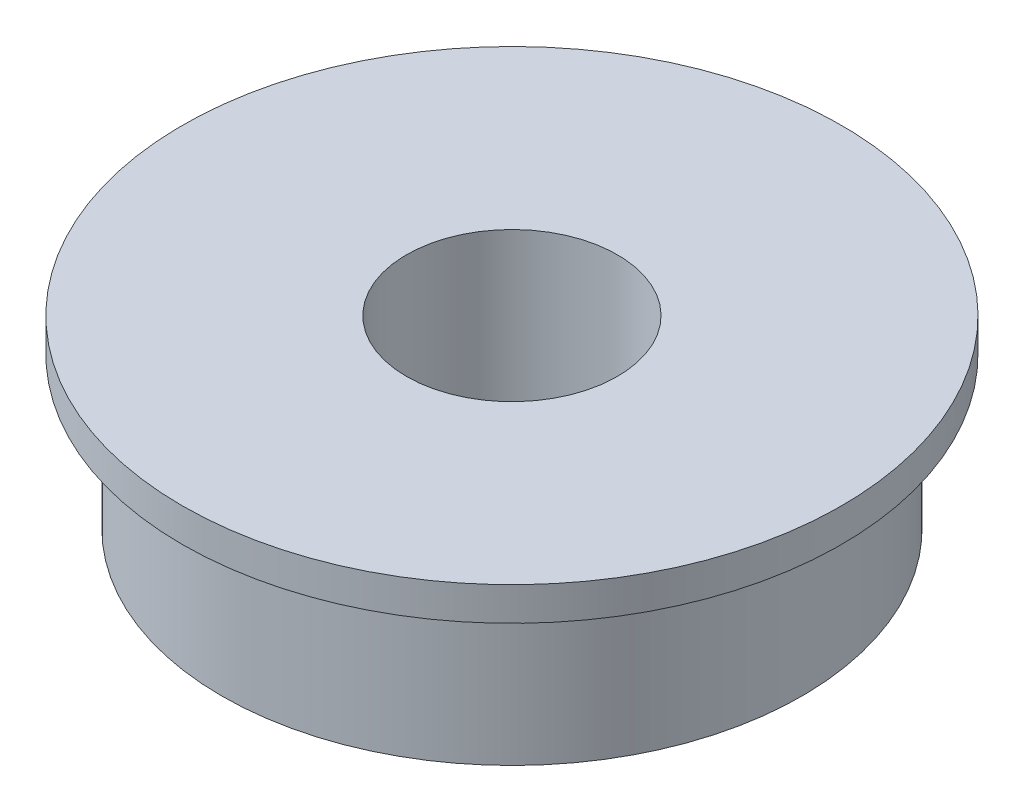
ISO-10303-21;
HEADER;
FILE_DESCRIPTION(('STEP AP214'),'2;1');
FILE_NAME('part.step','',(''),(''),'','','');
FILE_SCHEMA(('AUTOMOTIVE_DESIGN { 1 0 10303 214 1 1 1 1 }'));
ENDSEC;
DATA;
#1=APPLICATION_CONTEXT('core data for automotive mechanical design processes');
#2=APPLICATION_PROTOCOL_DEFINITION('international standard','automotive_design',2000,#1);
#3=PRODUCT_CONTEXT('',#1,'mechanical');
#4=PRODUCT('Part','Part','',(#3));
#5=PRODUCT_RELATED_PRODUCT_CATEGORY('part','',(#4));
#6=PRODUCT_DEFINITION_FORMATION('','',#4);
#7=PRODUCT_DEFINITION_CONTEXT('part definition',#1,'design');
#8=PRODUCT_DEFINITION('design','',#6,#7);
#9=PRODUCT_DEFINITION_SHAPE('','',#8);
#10=(LENGTH_UNIT() NAMED_UNIT(*) SI_UNIT(.MILLI.,.METRE.));
#11=(NAMED_UNIT(*) PLANE_ANGLE_UNIT() SI_UNIT($,.RADIAN.));
#12=(NAMED_UNIT(*) SI_UNIT($,.STERADIAN.) SOLID_ANGLE_UNIT());
#13=UNCERTAINTY_MEASURE_WITH_UNIT(LENGTH_MEASURE(1.E-05),#10,'distance_accuracy_value','');
#14=(GEOMETRIC_REPRESENTATION_CONTEXT(3) GLOBAL_UNCERTAINTY_ASSIGNED_CONTEXT((#13)) GLOBAL_UNIT_ASSIGNED_CONTEXT((#10,
#11,#12)) REPRESENTATION_CONTEXT('',''));
#15=CARTESIAN_POINT('',(0.,0.,0.));
#16=DIRECTION('',(0.,0.,1.));
#17=DIRECTION('',(1.,0.,0.));
#18=AXIS2_PLACEMENT_3D('',#15,#16,#17);
#19=CARTESIAN_POINT('',(0.,7.,0.));
#20=DIRECTION('',(0.,-1.,0.));
#21=DIRECTION('',(0.,0.,-1.));
#22=AXIS2_PLACEMENT_3D('',#19,#20,#21);
#23=CYLINDRICAL_SURFACE('',#22,11.);
#24=CARTESIAN_POINT('',(0.,0.,0.));
#25=DIRECTION('',(0.,1.,0.));
#26=DIRECTION('',(0.,0.,1.));
#27=AXIS2_PLACEMENT_3D('',#24,#25,#26);
#28=CIRCLE('',#27,11.);
#29=CARTESIAN_POINT('',(0.,0.,11.));
#30=VERTEX_POINT('',#29);
#31=EDGE_CURVE('E37',#30,#30,#28,.T.);
#32=ORIENTED_EDGE('',*,*,#31,.T.);
#33=EDGE_LOOP('',(#32));
#34=FACE_BOUND('',#33,.T.);
#35=CARTESIAN_POINT('',(0.,5.73,0.));
#36=DIRECTION('',(0.,1.,0.));
#37=DIRECTION('',(0.,0.,1.));
#38=AXIS2_PLACEMENT_3D('',#35,#36,#37);
#39=CIRCLE('',#38,11.);
#40=CARTESIAN_POINT('',(0.,5.73,11.));
#41=VERTEX_POINT('',#40);
#42=EDGE_CURVE('E10',#41,#41,#39,.T.);
#43=ORIENTED_EDGE('',*,*,#42,.F.);
#44=EDGE_LOOP('',(#43));
#45=FACE_BOUND('',#44,.T.);
#46=ADVANCED_FACE('F31',(#34,#45),#23,.T.);
#47=CARTESIAN_POINT('',(0.,7.,0.));
#48=DIRECTION('',(0.,1.,0.));
#49=DIRECTION('',(0.,0.,1.));
#50=AXIS2_PLACEMENT_3D('',#47,#48,#49);
#51=PLANE('',#50);
#52=CARTESIAN_POINT('',(0.,7.,0.));
#53=DIRECTION('',(0.,1.,0.));
#54=DIRECTION('',(0.,0.,1.));
#55=AXIS2_PLACEMENT_3D('',#52,#53,#54);
#56=CIRCLE('',#55,4.);
#57=CARTESIAN_POINT('',(0.,7.,4.));
#58=VERTEX_POINT('',#57);
#59=EDGE_CURVE('E41',#58,#58,#56,.T.);
#60=ORIENTED_EDGE('',*,*,#59,.F.);
#61=EDGE_LOOP('',(#60));
#62=FACE_BOUND('',#61,.T.);
#63=CARTESIAN_POINT('',(0.,7.,0.));
#64=DIRECTION('',(0.,1.,0.));
#65=DIRECTION('',(0.,0.,1.));
#66=AXIS2_PLACEMENT_3D('',#63,#64,#65);
#67=CIRCLE('',#66,12.5);
#68=CARTESIAN_POINT('',(0.,7.,12.5));
#69=VERTEX_POINT('',#68);
#70=EDGE_CURVE('E51',#69,#69,#67,.T.);
#71=ORIENTED_EDGE('',*,*,#70,.T.);
#72=EDGE_LOOP('',(#71));
#73=FACE_BOUND('',#72,.T.);
#74=ADVANCED_FACE('F69',(#62,#73),#51,.T.);
#75=CARTESIAN_POINT('',(0.,0.,0.));
#76=DIRECTION('',(0.,1.,0.));
#77=DIRECTION('',(0.,0.,1.));
#78=AXIS2_PLACEMENT_3D('',#75,#76,#77);
#79=PLANE('',#78);
#80=ORIENTED_EDGE('',*,*,#31,.F.);
#81=EDGE_LOOP('',(#80));
#82=FACE_BOUND('',#81,.T.);
#83=CARTESIAN_POINT('',(0.,0.,0.));
#84=DIRECTION('',(0.,1.,0.));
#85=DIRECTION('',(0.,0.,1.));
#86=AXIS2_PLACEMENT_3D('',#83,#84,#85);
#87=CIRCLE('',#86,4.);
#88=CARTESIAN_POINT('',(0.,0.,4.));
#89=VERTEX_POINT('',#88);
#90=EDGE_CURVE('E45',#89,#89,#87,.T.);
#91=ORIENTED_EDGE('',*,*,#90,.T.);
#92=EDGE_LOOP('',(#91));
#93=FACE_BOUND('',#92,.T.);
#94=ADVANCED_FACE('F73',(#82,#93),#79,.F.);
#95=CARTESIAN_POINT('',(0.,7.,0.));
#96=DIRECTION('',(0.,-1.,0.));
#97=DIRECTION('',(0.,0.,-1.));
#98=AXIS2_PLACEMENT_3D('',#95,#96,#97);
#99=CYLINDRICAL_SURFACE('',#98,4.);
#100=ORIENTED_EDGE('',*,*,#59,.T.);
#101=EDGE_LOOP('',(#100));
#102=FACE_BOUND('',#101,.T.);
#103=ORIENTED_EDGE('',*,*,#90,.F.);
#104=EDGE_LOOP('',(#103));
#105=FACE_BOUND('',#104,.T.);
#106=ADVANCED_FACE('F66',(#102,#105),#99,.F.);
#107=CARTESIAN_POINT('',(0.,5.73,0.));
#108=DIRECTION('',(0.,1.,0.));
#109=DIRECTION('',(0.,0.,1.));
#110=AXIS2_PLACEMENT_3D('',#107,#108,#109);
#111=CYLINDRICAL_SURFACE('',#110,12.5);
#112=CARTESIAN_POINT('',(0.,5.73,0.));
#113=DIRECTION('',(0.,1.,0.));
#114=DIRECTION('',(0.,0.,1.));
#115=AXIS2_PLACEMENT_3D('',#112,#113,#114);
#116=CIRCLE('',#115,12.5);
#117=CARTESIAN_POINT('',(0.,5.73,12.5));
#118=VERTEX_POINT('',#117);
#119=EDGE_CURVE('E49',#118,#118,#116,.T.);
#120=ORIENTED_EDGE('',*,*,#119,.T.);
#121=EDGE_LOOP('',(#120));
#122=FACE_BOUND('',#121,.T.);
#123=ORIENTED_EDGE('',*,*,#70,.F.);
#124=EDGE_LOOP('',(#123));
#125=FACE_BOUND('',#124,.T.);
#126=ADVANCED_FACE('F57',(#122,#125),#111,.T.);
#127=CARTESIAN_POINT('',(0.,5.73,0.));
#128=DIRECTION('',(0.,1.,0.));
#129=DIRECTION('',(0.,0.,1.));
#130=AXIS2_PLACEMENT_3D('',#127,#128,#129);
#131=PLANE('',#130);
#132=ORIENTED_EDGE('',*,*,#42,.T.);
#133=EDGE_LOOP('',(#132));
#134=FACE_BOUND('',#133,.T.);
#135=ORIENTED_EDGE('',*,*,#119,.F.);
#136=EDGE_LOOP('',(#135));
#137=FACE_BOUND('',#136,.T.);
#138=ADVANCED_FACE('F60',(#134,#137),#131,.F.);
#139=CLOSED_SHELL('',(#46,#74,#94,#106,#126,#138));
#140=MANIFOLD_SOLID_BREP('B2',#139);
#141=ADVANCED_BREP_SHAPE_REPRESENTATION('',(#18,#140),#14);
#142=SHAPE_DEFINITION_REPRESENTATION(#9,#141);
ENDSEC;
END-ISO-10303-21;
